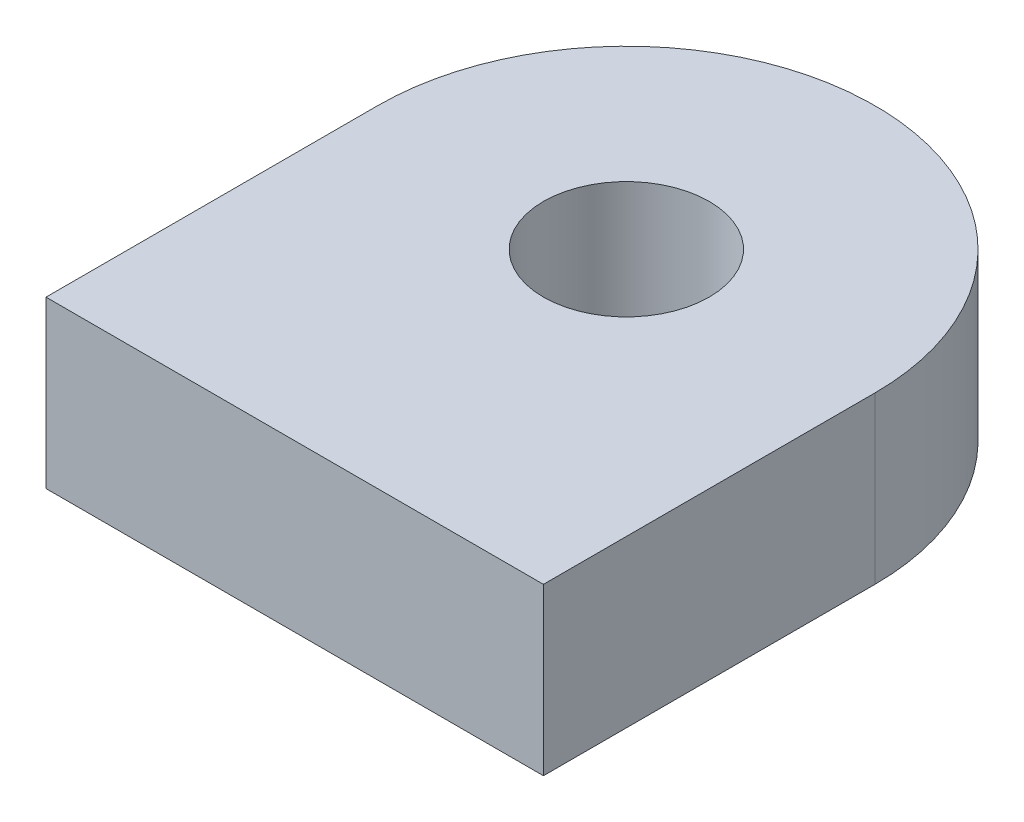
ISO-10303-21;
HEADER;
FILE_DESCRIPTION(('STEP AP214'),'2;1');
FILE_NAME('part.step','',(''),(''),'','','');
FILE_SCHEMA(('AUTOMOTIVE_DESIGN { 1 0 10303 214 1 1 1 1 }'));
ENDSEC;
DATA;
#1=APPLICATION_CONTEXT('core data for automotive mechanical design processes');
#2=APPLICATION_PROTOCOL_DEFINITION('international standard','automotive_design',2000,#1);
#3=PRODUCT_CONTEXT('',#1,'mechanical');
#4=PRODUCT('Part','Part','',(#3));
#5=PRODUCT_RELATED_PRODUCT_CATEGORY('part','',(#4));
#6=PRODUCT_DEFINITION_FORMATION('','',#4);
#7=PRODUCT_DEFINITION_CONTEXT('part definition',#1,'design');
#8=PRODUCT_DEFINITION('design','',#6,#7);
#9=PRODUCT_DEFINITION_SHAPE('','',#8);
#10=(LENGTH_UNIT() NAMED_UNIT(*) SI_UNIT(.MILLI.,.METRE.));
#11=(NAMED_UNIT(*) PLANE_ANGLE_UNIT() SI_UNIT($,.RADIAN.));
#12=(NAMED_UNIT(*) SI_UNIT($,.STERADIAN.) SOLID_ANGLE_UNIT());
#13=UNCERTAINTY_MEASURE_WITH_UNIT(LENGTH_MEASURE(1.E-05),#10,'distance_accuracy_value','');
#14=(GEOMETRIC_REPRESENTATION_CONTEXT(3) GLOBAL_UNCERTAINTY_ASSIGNED_CONTEXT((#13)) GLOBAL_UNIT_ASSIGNED_CONTEXT((#10,
#11,#12)) REPRESENTATION_CONTEXT('',''));
#15=CARTESIAN_POINT('',(0.,0.,0.));
#16=DIRECTION('',(0.,0.,1.));
#17=DIRECTION('',(1.,0.,0.));
#18=AXIS2_PLACEMENT_3D('',#15,#16,#17);
#19=CARTESIAN_POINT('',(0.,12.7,0.));
#20=DIRECTION('',(0.,1.,0.));
#21=DIRECTION('',(0.,0.,1.));
#22=AXIS2_PLACEMENT_3D('',#19,#20,#21);
#23=PLANE('',#22);
#24=CARTESIAN_POINT('',(0.,12.7,0.));
#25=DIRECTION('',(0.,1.,0.));
#26=DIRECTION('',(0.,0.,1.));
#27=AXIS2_PLACEMENT_3D('',#24,#25,#26);
#28=CIRCLE('',#27,19.05);
#29=CARTESIAN_POINT('',(19.05,12.7,0.));
#30=VERTEX_POINT('',#29);
#31=CARTESIAN_POINT('',(-19.05,12.7,0.));
#32=VERTEX_POINT('',#31);
#33=EDGE_CURVE('E92',#30,#32,#28,.T.);
#34=ORIENTED_EDGE('',*,*,#33,.T.);
#35=DIRECTION('',(0.,0.,1.));
#36=VECTOR('',#35,1.);
#37=CARTESIAN_POINT('',(-19.05,12.7,0.));
#38=LINE('',#37,#36);
#39=CARTESIAN_POINT('',(-19.05,12.7,25.4));
#40=VERTEX_POINT('',#39);
#41=EDGE_CURVE('E87',#32,#40,#38,.T.);
#42=ORIENTED_EDGE('',*,*,#41,.T.);
#43=DIRECTION('',(1.,0.,0.));
#44=VECTOR('',#43,1.);
#45=CARTESIAN_POINT('',(-19.05,12.7,25.4));
#46=LINE('',#45,#44);
#47=CARTESIAN_POINT('',(19.05,12.7,25.4));
#48=VERTEX_POINT('',#47);
#49=EDGE_CURVE('E90',#40,#48,#46,.T.);
#50=ORIENTED_EDGE('',*,*,#49,.T.);
#51=DIRECTION('',(0.,0.,-1.));
#52=VECTOR('',#51,1.);
#53=CARTESIAN_POINT('',(19.05,12.7,25.4));
#54=LINE('',#53,#52);
#55=EDGE_CURVE('E57',#48,#30,#54,.T.);
#56=ORIENTED_EDGE('',*,*,#55,.T.);
#57=EDGE_LOOP('',(#34,#42,#50,#56));
#58=FACE_BOUND('',#57,.T.);
#59=CARTESIAN_POINT('',(0.,12.7,0.));
#60=DIRECTION('',(0.,1.,0.));
#61=DIRECTION('',(0.,0.,1.));
#62=AXIS2_PLACEMENT_3D('',#59,#60,#61);
#63=CIRCLE('',#62,6.35);
#64=CARTESIAN_POINT('',(0.,12.7,6.35));
#65=VERTEX_POINT('',#64);
#66=EDGE_CURVE('E112',#65,#65,#63,.T.);
#67=ORIENTED_EDGE('',*,*,#66,.F.);
#68=EDGE_LOOP('',(#67));
#69=FACE_BOUND('',#68,.T.);
#70=ADVANCED_FACE('F39',(#58,#69),#23,.T.);
#71=CARTESIAN_POINT('',(0.,0.,0.));
#72=DIRECTION('',(0.,1.,0.));
#73=DIRECTION('',(0.,0.,1.));
#74=AXIS2_PLACEMENT_3D('',#71,#72,#73);
#75=PLANE('',#74);
#76=CARTESIAN_POINT('',(0.,0.,0.));
#77=DIRECTION('',(0.,1.,0.));
#78=DIRECTION('',(0.,0.,1.));
#79=AXIS2_PLACEMENT_3D('',#76,#77,#78);
#80=CIRCLE('',#79,19.05);
#81=CARTESIAN_POINT('',(19.05,0.,0.));
#82=VERTEX_POINT('',#81);
#83=CARTESIAN_POINT('',(-19.05,0.,0.));
#84=VERTEX_POINT('',#83);
#85=EDGE_CURVE('E108',#82,#84,#80,.T.);
#86=ORIENTED_EDGE('',*,*,#85,.F.);
#87=DIRECTION('',(0.,0.,-1.));
#88=VECTOR('',#87,1.);
#89=CARTESIAN_POINT('',(19.05,0.,25.4));
#90=LINE('',#89,#88);
#91=CARTESIAN_POINT('',(19.05,0.,25.4));
#92=VERTEX_POINT('',#91);
#93=EDGE_CURVE('E80',#92,#82,#90,.T.);
#94=ORIENTED_EDGE('',*,*,#93,.F.);
#95=DIRECTION('',(1.,0.,0.));
#96=VECTOR('',#95,1.);
#97=CARTESIAN_POINT('',(-19.05,0.,25.4));
#98=LINE('',#97,#96);
#99=CARTESIAN_POINT('',(-19.05,0.,25.4));
#100=VERTEX_POINT('',#99);
#101=EDGE_CURVE('E74',#100,#92,#98,.T.);
#102=ORIENTED_EDGE('',*,*,#101,.F.);
#103=DIRECTION('',(0.,0.,1.));
#104=VECTOR('',#103,1.);
#105=CARTESIAN_POINT('',(-19.05,0.,0.));
#106=LINE('',#105,#104);
#107=EDGE_CURVE('E97',#84,#100,#106,.T.);
#108=ORIENTED_EDGE('',*,*,#107,.F.);
#109=EDGE_LOOP('',(#86,#94,#102,#108));
#110=FACE_BOUND('',#109,.T.);
#111=CARTESIAN_POINT('',(0.,0.,0.));
#112=DIRECTION('',(0.,1.,0.));
#113=DIRECTION('',(0.,0.,1.));
#114=AXIS2_PLACEMENT_3D('',#111,#112,#113);
#115=CIRCLE('',#114,6.35);
#116=CARTESIAN_POINT('',(0.,0.,6.35));
#117=VERTEX_POINT('',#116);
#118=EDGE_CURVE('E130',#117,#117,#115,.T.);
#119=ORIENTED_EDGE('',*,*,#118,.T.);
#120=EDGE_LOOP('',(#119));
#121=FACE_BOUND('',#120,.T.);
#122=ADVANCED_FACE('F125',(#110,#121),#75,.F.);
#123=CARTESIAN_POINT('',(0.,12.7,0.));
#124=DIRECTION('',(0.,-1.,0.));
#125=DIRECTION('',(0.,0.,-1.));
#126=AXIS2_PLACEMENT_3D('',#123,#124,#125);
#127=CYLINDRICAL_SURFACE('',#126,19.05);
#128=ORIENTED_EDGE('',*,*,#85,.T.);
#129=DIRECTION('',(0.,-1.,0.));
#130=VECTOR('',#129,1.);
#131=CARTESIAN_POINT('',(-19.05,12.7,0.));
#132=LINE('',#131,#130);
#133=EDGE_CURVE('E11',#32,#84,#132,.T.);
#134=ORIENTED_EDGE('',*,*,#133,.F.);
#135=ORIENTED_EDGE('',*,*,#33,.F.);
#136=DIRECTION('',(0.,-1.,0.));
#137=VECTOR('',#136,1.);
#138=CARTESIAN_POINT('',(19.05,12.7,0.));
#139=LINE('',#138,#137);
#140=EDGE_CURVE('E104',#30,#82,#139,.T.);
#141=ORIENTED_EDGE('',*,*,#140,.T.);
#142=EDGE_LOOP('',(#128,#134,#135,#141));
#143=FACE_BOUND('',#142,.T.);
#144=ADVANCED_FACE('F41',(#143),#127,.T.);
#145=CARTESIAN_POINT('',(-19.05,12.7,0.));
#146=DIRECTION('',(1.,0.,0.));
#147=DIRECTION('',(0.,0.,-1.));
#148=AXIS2_PLACEMENT_3D('',#145,#146,#147);
#149=PLANE('',#148);
#150=ORIENTED_EDGE('',*,*,#107,.T.);
#151=DIRECTION('',(0.,-1.,0.));
#152=VECTOR('',#151,1.);
#153=CARTESIAN_POINT('',(-19.05,12.7,25.4));
#154=LINE('',#153,#152);
#155=EDGE_CURVE('E49',#40,#100,#154,.T.);
#156=ORIENTED_EDGE('',*,*,#155,.F.);
#157=ORIENTED_EDGE('',*,*,#41,.F.);
#158=ORIENTED_EDGE('',*,*,#133,.T.);
#159=EDGE_LOOP('',(#150,#156,#157,#158));
#160=FACE_BOUND('',#159,.T.);
#161=ADVANCED_FACE('F96',(#160),#149,.F.);
#162=CARTESIAN_POINT('',(-19.05,12.7,25.4));
#163=DIRECTION('',(0.,0.,-1.));
#164=DIRECTION('',(-1.,0.,0.));
#165=AXIS2_PLACEMENT_3D('',#162,#163,#164);
#166=PLANE('',#165);
#167=ORIENTED_EDGE('',*,*,#101,.T.);
#168=DIRECTION('',(0.,-1.,0.));
#169=VECTOR('',#168,1.);
#170=CARTESIAN_POINT('',(19.05,12.7,25.4));
#171=LINE('',#170,#169);
#172=EDGE_CURVE('E99',#48,#92,#171,.T.);
#173=ORIENTED_EDGE('',*,*,#172,.F.);
#174=ORIENTED_EDGE('',*,*,#49,.F.);
#175=ORIENTED_EDGE('',*,*,#155,.T.);
#176=EDGE_LOOP('',(#167,#173,#174,#175));
#177=FACE_BOUND('',#176,.T.);
#178=ADVANCED_FACE('F100',(#177),#166,.F.);
#179=CARTESIAN_POINT('',(19.05,12.7,25.4));
#180=DIRECTION('',(-1.,0.,0.));
#181=DIRECTION('',(0.,0.,1.));
#182=AXIS2_PLACEMENT_3D('',#179,#180,#181);
#183=PLANE('',#182);
#184=ORIENTED_EDGE('',*,*,#93,.T.);
#185=ORIENTED_EDGE('',*,*,#140,.F.);
#186=ORIENTED_EDGE('',*,*,#55,.F.);
#187=ORIENTED_EDGE('',*,*,#172,.T.);
#188=EDGE_LOOP('',(#184,#185,#186,#187));
#189=FACE_BOUND('',#188,.T.);
#190=ADVANCED_FACE('F122',(#189),#183,.F.);
#191=CARTESIAN_POINT('',(0.,12.7,0.));
#192=DIRECTION('',(0.,-1.,0.));
#193=DIRECTION('',(0.,0.,-1.));
#194=AXIS2_PLACEMENT_3D('',#191,#192,#193);
#195=CYLINDRICAL_SURFACE('',#194,6.35);
#196=ORIENTED_EDGE('',*,*,#66,.T.);
#197=EDGE_LOOP('',(#196));
#198=FACE_BOUND('',#197,.T.);
#199=ORIENTED_EDGE('',*,*,#118,.F.);
#200=EDGE_LOOP('',(#199));
#201=FACE_BOUND('',#200,.T.);
#202=ADVANCED_FACE('F138',(#198,#201),#195,.F.);
#203=CLOSED_SHELL('',(#70,#122,#144,#161,#178,#190,#202));
#204=MANIFOLD_SOLID_BREP('B2',#203);
#205=ADVANCED_BREP_SHAPE_REPRESENTATION('',(#18,#204),#14);
#206=SHAPE_DEFINITION_REPRESENTATION(#9,#205);
ENDSEC;
END-ISO-10303-21;
